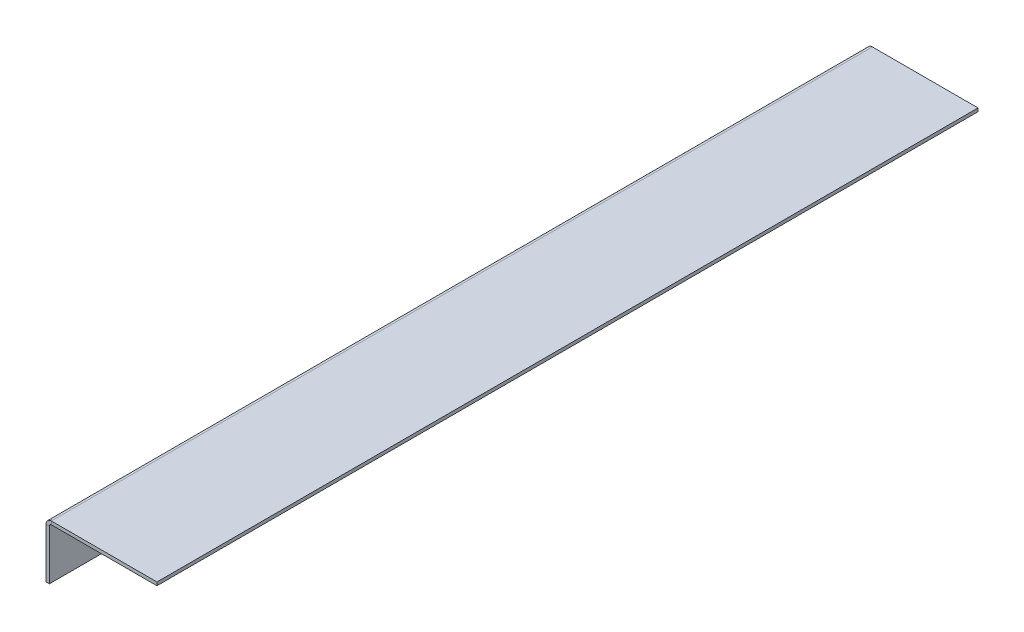
ISO-10303-21;
HEADER;
FILE_DESCRIPTION(('STEP AP214'),'2;1');
FILE_NAME('part.step','',(''),(''),'','','');
FILE_SCHEMA(('AUTOMOTIVE_DESIGN { 1 0 10303 214 1 1 1 1 }'));
ENDSEC;
DATA;
#1=APPLICATION_CONTEXT('core data for automotive mechanical design processes');
#2=APPLICATION_PROTOCOL_DEFINITION('international standard','automotive_design',2000,#1);
#3=PRODUCT_CONTEXT('',#1,'mechanical');
#4=PRODUCT('Part','Part','',(#3));
#5=PRODUCT_RELATED_PRODUCT_CATEGORY('part','',(#4));
#6=PRODUCT_DEFINITION_FORMATION('','',#4);
#7=PRODUCT_DEFINITION_CONTEXT('part definition',#1,'design');
#8=PRODUCT_DEFINITION('design','',#6,#7);
#9=PRODUCT_DEFINITION_SHAPE('','',#8);
#10=(LENGTH_UNIT() NAMED_UNIT(*) SI_UNIT(.MILLI.,.METRE.));
#11=(NAMED_UNIT(*) PLANE_ANGLE_UNIT() SI_UNIT($,.RADIAN.));
#12=(NAMED_UNIT(*) SI_UNIT($,.STERADIAN.) SOLID_ANGLE_UNIT());
#13=UNCERTAINTY_MEASURE_WITH_UNIT(LENGTH_MEASURE(1.E-05),#10,'distance_accuracy_value','');
#14=(GEOMETRIC_REPRESENTATION_CONTEXT(3) GLOBAL_UNCERTAINTY_ASSIGNED_CONTEXT((#13)) GLOBAL_UNIT_ASSIGNED_CONTEXT((#10,
#11,#12)) REPRESENTATION_CONTEXT('',''));
#15=CARTESIAN_POINT('',(0.,0.,0.));
#16=DIRECTION('',(0.,0.,1.));
#17=DIRECTION('',(1.,0.,0.));
#18=AXIS2_PLACEMENT_3D('',#15,#16,#17);
#19=CARTESIAN_POINT('',(1.9366,20.,296.));
#20=DIRECTION('',(0.,0.,1.));
#21=DIRECTION('',(1.,0.,0.));
#22=AXIS2_PLACEMENT_3D('',#19,#20,#21);
#23=PLANE('',#22);
#24=DIRECTION('',(0.,-1.,0.));
#25=VECTOR('',#24,1.);
#26=CARTESIAN_POINT('',(1.9366,20.,296.));
#27=LINE('',#26,#25);
#28=CARTESIAN_POINT('',(1.9366,20.,296.));
#29=VERTEX_POINT('',#28);
#30=CARTESIAN_POINT('',(1.9366,18.8,296.));
#31=VERTEX_POINT('',#30);
#32=EDGE_CURVE('E11',#29,#31,#27,.T.);
#33=ORIENTED_EDGE('',*,*,#32,.F.);
#34=CARTESIAN_POINT('',(1.9366,18.0634,296.));
#35=DIRECTION('',(0.,0.,1.));
#36=DIRECTION('',(1.,0.,0.));
#37=AXIS2_PLACEMENT_3D('',#34,#35,#36);
#38=CIRCLE('',#37,1.9366);
#39=CARTESIAN_POINT('',(0.,18.0634,296.));
#40=VERTEX_POINT('',#39);
#41=EDGE_CURVE('E140',#40,#29,#38,.F.);
#42=ORIENTED_EDGE('',*,*,#41,.F.);
#43=DIRECTION('',(-1.,0.,0.));
#44=VECTOR('',#43,1.);
#45=CARTESIAN_POINT('',(1.2,18.0634,296.));
#46=LINE('',#45,#44);
#47=CARTESIAN_POINT('',(1.2,18.0634,296.));
#48=VERTEX_POINT('',#47);
#49=EDGE_CURVE('E51',#48,#40,#46,.T.);
#50=ORIENTED_EDGE('',*,*,#49,.F.);
#51=CARTESIAN_POINT('',(1.9366,18.0634,296.));
#52=DIRECTION('',(0.,0.,1.));
#53=DIRECTION('',(1.,0.,0.));
#54=AXIS2_PLACEMENT_3D('',#51,#52,#53);
#55=CIRCLE('',#54,0.7366);
#56=EDGE_CURVE('E133',#48,#31,#55,.F.);
#57=ORIENTED_EDGE('',*,*,#56,.T.);
#58=EDGE_LOOP('',(#33,#42,#50,#57));
#59=FACE_BOUND('',#58,.T.);
#60=ADVANCED_FACE('F43',(#59),#23,.T.);
#61=CARTESIAN_POINT('',(1.2,18.0634,296.));
#62=DIRECTION('',(0.,0.,1.));
#63=DIRECTION('',(1.,0.,0.));
#64=AXIS2_PLACEMENT_3D('',#61,#62,#63);
#65=PLANE('',#64);
#66=DIRECTION('',(1.,0.,0.));
#67=VECTOR('',#66,1.);
#68=CARTESIAN_POINT('',(0.,20.,296.));
#69=LINE('',#68,#67);
#70=CARTESIAN_POINT('',(40.,20.,296.));
#71=VERTEX_POINT('',#70);
#72=EDGE_CURVE('E189',#29,#71,#69,.T.);
#73=ORIENTED_EDGE('',*,*,#72,.F.);
#74=ORIENTED_EDGE('',*,*,#32,.T.);
#75=DIRECTION('',(1.,0.,0.));
#76=VECTOR('',#75,1.);
#77=CARTESIAN_POINT('',(0.,18.8,296.));
#78=LINE('',#77,#76);
#79=CARTESIAN_POINT('',(40.,18.8,296.));
#80=VERTEX_POINT('',#79);
#81=EDGE_CURVE('E99',#31,#80,#78,.T.);
#82=ORIENTED_EDGE('',*,*,#81,.T.);
#83=DIRECTION('',(0.,-1.,0.));
#84=VECTOR('',#83,1.);
#85=CARTESIAN_POINT('',(40.,20.,296.));
#86=LINE('',#85,#84);
#87=EDGE_CURVE('E374',#71,#80,#86,.T.);
#88=ORIENTED_EDGE('',*,*,#87,.F.);
#89=EDGE_LOOP('',(#73,#74,#82,#88));
#90=FACE_BOUND('',#89,.T.);
#91=ADVANCED_FACE('F197',(#90),#65,.T.);
#92=CARTESIAN_POINT('',(0.,18.0634,0.));
#93=DIRECTION('',(0.,0.,-1.));
#94=DIRECTION('',(-1.,0.,0.));
#95=AXIS2_PLACEMENT_3D('',#92,#93,#94);
#96=PLANE('',#95);
#97=DIRECTION('',(1.,0.,0.));
#98=VECTOR('',#97,1.);
#99=CARTESIAN_POINT('',(0.,18.0634,0.));
#100=LINE('',#99,#98);
#101=CARTESIAN_POINT('',(0.,18.0634,0.));
#102=VERTEX_POINT('',#101);
#103=CARTESIAN_POINT('',(1.2,18.0634,0.));
#104=VERTEX_POINT('',#103);
#105=EDGE_CURVE('E86',#102,#104,#100,.T.);
#106=ORIENTED_EDGE('',*,*,#105,.F.);
#107=CARTESIAN_POINT('',(1.9366,18.0634,0.));
#108=DIRECTION('',(0.,0.,1.));
#109=DIRECTION('',(1.,0.,0.));
#110=AXIS2_PLACEMENT_3D('',#107,#108,#109);
#111=CIRCLE('',#110,1.9366);
#112=CARTESIAN_POINT('',(1.9366,20.,0.));
#113=VERTEX_POINT('',#112);
#114=EDGE_CURVE('E155',#102,#113,#111,.F.);
#115=ORIENTED_EDGE('',*,*,#114,.T.);
#116=DIRECTION('',(0.,1.,0.));
#117=VECTOR('',#116,1.);
#118=CARTESIAN_POINT('',(1.9366,18.8,0.));
#119=LINE('',#118,#117);
#120=CARTESIAN_POINT('',(1.9366,18.8,0.));
#121=VERTEX_POINT('',#120);
#122=EDGE_CURVE('E93',#121,#113,#119,.T.);
#123=ORIENTED_EDGE('',*,*,#122,.F.);
#124=CARTESIAN_POINT('',(1.9366,18.0634,0.));
#125=DIRECTION('',(0.,0.,1.));
#126=DIRECTION('',(1.,0.,0.));
#127=AXIS2_PLACEMENT_3D('',#124,#125,#126);
#128=CIRCLE('',#127,0.7366);
#129=EDGE_CURVE('E162',#104,#121,#128,.F.);
#130=ORIENTED_EDGE('',*,*,#129,.F.);
#131=EDGE_LOOP('',(#106,#115,#123,#130));
#132=FACE_BOUND('',#131,.T.);
#133=ADVANCED_FACE('F195',(#132),#96,.T.);
#134=CARTESIAN_POINT('',(1.9366,18.8,0.));
#135=DIRECTION('',(0.,0.,-1.));
#136=DIRECTION('',(-1.,0.,0.));
#137=AXIS2_PLACEMENT_3D('',#134,#135,#136);
#138=PLANE('',#137);
#139=DIRECTION('',(0.,1.,0.));
#140=VECTOR('',#139,1.);
#141=CARTESIAN_POINT('',(0.,0.,0.));
#142=LINE('',#141,#140);
#143=CARTESIAN_POINT('',(0.,0.,0.));
#144=VERTEX_POINT('',#143);
#145=EDGE_CURVE('E157',#144,#102,#142,.T.);
#146=ORIENTED_EDGE('',*,*,#145,.T.);
#147=ORIENTED_EDGE('',*,*,#105,.T.);
#148=DIRECTION('',(0.,1.,0.));
#149=VECTOR('',#148,1.);
#150=CARTESIAN_POINT('',(1.2,0.,0.));
#151=LINE('',#150,#149);
#152=CARTESIAN_POINT('',(1.2,0.,0.));
#153=VERTEX_POINT('',#152);
#154=EDGE_CURVE('E160',#153,#104,#151,.T.);
#155=ORIENTED_EDGE('',*,*,#154,.F.);
#156=DIRECTION('',(-1.,0.,0.));
#157=VECTOR('',#156,1.);
#158=CARTESIAN_POINT('',(1.2,0.,0.));
#159=LINE('',#158,#157);
#160=EDGE_CURVE('E121',#153,#144,#159,.T.);
#161=ORIENTED_EDGE('',*,*,#160,.T.);
#162=EDGE_LOOP('',(#146,#147,#155,#161));
#163=FACE_BOUND('',#162,.T.);
#164=ADVANCED_FACE('F191',(#163),#138,.T.);
#165=CARTESIAN_POINT('',(0.,18.8,296.));
#166=DIRECTION('',(0.,1.,0.));
#167=DIRECTION('',(0.,0.,1.));
#168=AXIS2_PLACEMENT_3D('',#165,#166,#167);
#169=PLANE('',#168);
#170=DIRECTION('',(1.,0.,0.));
#171=VECTOR('',#170,1.);
#172=CARTESIAN_POINT('',(0.,18.8,0.));
#173=LINE('',#172,#171);
#174=CARTESIAN_POINT('',(40.,18.8,0.));
#175=VERTEX_POINT('',#174);
#176=EDGE_CURVE('E146',#121,#175,#173,.T.);
#177=ORIENTED_EDGE('',*,*,#176,.T.);
#178=DIRECTION('',(0.,0.,-1.));
#179=VECTOR('',#178,1.);
#180=CARTESIAN_POINT('',(40.,18.8,296.));
#181=LINE('',#180,#179);
#182=EDGE_CURVE('E176',#80,#175,#181,.T.);
#183=ORIENTED_EDGE('',*,*,#182,.F.);
#184=ORIENTED_EDGE('',*,*,#81,.F.);
#185=DIRECTION('',(0.,0.,-1.));
#186=VECTOR('',#185,1.);
#187=CARTESIAN_POINT('',(1.9366,18.8,296.));
#188=LINE('',#187,#186);
#189=EDGE_CURVE('E145',#31,#121,#188,.T.);
#190=ORIENTED_EDGE('',*,*,#189,.T.);
#191=EDGE_LOOP('',(#177,#183,#184,#190));
#192=FACE_BOUND('',#191,.T.);
#193=ADVANCED_FACE('F203',(#192),#169,.F.);
#194=CARTESIAN_POINT('',(40.,20.,296.));
#195=DIRECTION('',(1.,0.,0.));
#196=DIRECTION('',(0.,0.,-1.));
#197=AXIS2_PLACEMENT_3D('',#194,#195,#196);
#198=PLANE('',#197);
#199=DIRECTION('',(0.,-1.,0.));
#200=VECTOR('',#199,1.);
#201=CARTESIAN_POINT('',(40.,20.,0.));
#202=LINE('',#201,#200);
#203=CARTESIAN_POINT('',(40.,20.,0.));
#204=VERTEX_POINT('',#203);
#205=EDGE_CURVE('E149',#204,#175,#202,.T.);
#206=ORIENTED_EDGE('',*,*,#205,.F.);
#207=DIRECTION('',(0.,0.,-1.));
#208=VECTOR('',#207,1.);
#209=CARTESIAN_POINT('',(40.,20.,296.));
#210=LINE('',#209,#208);
#211=EDGE_CURVE('E174',#71,#204,#210,.T.);
#212=ORIENTED_EDGE('',*,*,#211,.F.);
#213=ORIENTED_EDGE('',*,*,#87,.T.);
#214=ORIENTED_EDGE('',*,*,#182,.T.);
#215=EDGE_LOOP('',(#206,#212,#213,#214));
#216=FACE_BOUND('',#215,.T.);
#217=ADVANCED_FACE('F234',(#216),#198,.T.);
#218=CARTESIAN_POINT('',(0.,20.,296.));
#219=DIRECTION('',(0.,1.,0.));
#220=DIRECTION('',(0.,0.,1.));
#221=AXIS2_PLACEMENT_3D('',#218,#219,#220);
#222=PLANE('',#221);
#223=DIRECTION('',(1.,0.,0.));
#224=VECTOR('',#223,1.);
#225=CARTESIAN_POINT('',(0.,20.,0.));
#226=LINE('',#225,#224);
#227=EDGE_CURVE('E152',#113,#204,#226,.T.);
#228=ORIENTED_EDGE('',*,*,#227,.F.);
#229=DIRECTION('',(0.,0.,-1.));
#230=VECTOR('',#229,1.);
#231=CARTESIAN_POINT('',(1.9366,20.,296.));
#232=LINE('',#231,#230);
#233=EDGE_CURVE('E171',#29,#113,#232,.T.);
#234=ORIENTED_EDGE('',*,*,#233,.F.);
#235=ORIENTED_EDGE('',*,*,#72,.T.);
#236=ORIENTED_EDGE('',*,*,#211,.T.);
#237=EDGE_LOOP('',(#228,#234,#235,#236));
#238=FACE_BOUND('',#237,.T.);
#239=ADVANCED_FACE('F245',(#238),#222,.T.);
#240=CARTESIAN_POINT('',(1.9366,18.0634,296.));
#241=DIRECTION('',(0.,0.,-1.));
#242=DIRECTION('',(-1.,0.,0.));
#243=AXIS2_PLACEMENT_3D('',#240,#241,#242);
#244=CYLINDRICAL_SURFACE('',#243,1.9366);
#245=ORIENTED_EDGE('',*,*,#114,.F.);
#246=DIRECTION('',(0.,0.,-1.));
#247=VECTOR('',#246,1.);
#248=CARTESIAN_POINT('',(0.,18.0634,296.));
#249=LINE('',#248,#247);
#250=EDGE_CURVE('E168',#40,#102,#249,.T.);
#251=ORIENTED_EDGE('',*,*,#250,.F.);
#252=ORIENTED_EDGE('',*,*,#41,.T.);
#253=ORIENTED_EDGE('',*,*,#233,.T.);
#254=EDGE_LOOP('',(#245,#251,#252,#253));
#255=FACE_BOUND('',#254,.T.);
#256=ADVANCED_FACE('F185',(#255),#244,.T.);
#257=CARTESIAN_POINT('',(0.,0.,296.));
#258=DIRECTION('',(-1.,0.,0.));
#259=DIRECTION('',(0.,0.,1.));
#260=AXIS2_PLACEMENT_3D('',#257,#258,#259);
#261=PLANE('',#260);
#262=ORIENTED_EDGE('',*,*,#145,.F.);
#263=DIRECTION('',(0.,0.,-1.));
#264=VECTOR('',#263,1.);
#265=CARTESIAN_POINT('',(0.,0.,296.));
#266=LINE('',#265,#264);
#267=CARTESIAN_POINT('',(0.,0.,296.));
#268=VERTEX_POINT('',#267);
#269=EDGE_CURVE('E123',#268,#144,#266,.T.);
#270=ORIENTED_EDGE('',*,*,#269,.F.);
#271=DIRECTION('',(0.,1.,0.));
#272=VECTOR('',#271,1.);
#273=CARTESIAN_POINT('',(0.,0.,296.));
#274=LINE('',#273,#272);
#275=EDGE_CURVE('E138',#268,#40,#274,.T.);
#276=ORIENTED_EDGE('',*,*,#275,.T.);
#277=ORIENTED_EDGE('',*,*,#250,.T.);
#278=EDGE_LOOP('',(#262,#270,#276,#277));
#279=FACE_BOUND('',#278,.T.);
#280=ADVANCED_FACE('F190',(#279),#261,.T.);
#281=CARTESIAN_POINT('',(1.2,0.,296.));
#282=DIRECTION('',(0.,-1.,0.));
#283=DIRECTION('',(0.,0.,-1.));
#284=AXIS2_PLACEMENT_3D('',#281,#282,#283);
#285=PLANE('',#284);
#286=ORIENTED_EDGE('',*,*,#160,.F.);
#287=DIRECTION('',(0.,0.,-1.));
#288=VECTOR('',#287,1.);
#289=CARTESIAN_POINT('',(1.2,0.,296.));
#290=LINE('',#289,#288);
#291=CARTESIAN_POINT('',(1.2,0.,296.));
#292=VERTEX_POINT('',#291);
#293=EDGE_CURVE('E115',#292,#153,#290,.T.);
#294=ORIENTED_EDGE('',*,*,#293,.F.);
#295=DIRECTION('',(-1.,0.,0.));
#296=VECTOR('',#295,1.);
#297=CARTESIAN_POINT('',(1.2,0.,296.));
#298=LINE('',#297,#296);
#299=EDGE_CURVE('E119',#292,#268,#298,.T.);
#300=ORIENTED_EDGE('',*,*,#299,.T.);
#301=ORIENTED_EDGE('',*,*,#269,.T.);
#302=EDGE_LOOP('',(#286,#294,#300,#301));
#303=FACE_BOUND('',#302,.T.);
#304=ADVANCED_FACE('F117',(#303),#285,.T.);
#305=CARTESIAN_POINT('',(1.2,0.,296.));
#306=DIRECTION('',(-1.,0.,0.));
#307=DIRECTION('',(0.,0.,1.));
#308=AXIS2_PLACEMENT_3D('',#305,#306,#307);
#309=PLANE('',#308);
#310=ORIENTED_EDGE('',*,*,#154,.T.);
#311=DIRECTION('',(0.,0.,-1.));
#312=VECTOR('',#311,1.);
#313=CARTESIAN_POINT('',(1.2,18.0634,296.));
#314=LINE('',#313,#312);
#315=EDGE_CURVE('E124',#48,#104,#314,.T.);
#316=ORIENTED_EDGE('',*,*,#315,.F.);
#317=DIRECTION('',(0.,1.,0.));
#318=VECTOR('',#317,1.);
#319=CARTESIAN_POINT('',(1.2,0.,296.));
#320=LINE('',#319,#318);
#321=EDGE_CURVE('E128',#292,#48,#320,.T.);
#322=ORIENTED_EDGE('',*,*,#321,.F.);
#323=ORIENTED_EDGE('',*,*,#293,.T.);
#324=EDGE_LOOP('',(#310,#316,#322,#323));
#325=FACE_BOUND('',#324,.T.);
#326=ADVANCED_FACE('F129',(#325),#309,.F.);
#327=CARTESIAN_POINT('',(1.9366,18.0634,296.));
#328=DIRECTION('',(0.,0.,-1.));
#329=DIRECTION('',(-1.,0.,0.));
#330=AXIS2_PLACEMENT_3D('',#327,#328,#329);
#331=CYLINDRICAL_SURFACE('',#330,0.7366);
#332=ORIENTED_EDGE('',*,*,#129,.T.);
#333=ORIENTED_EDGE('',*,*,#189,.F.);
#334=ORIENTED_EDGE('',*,*,#56,.F.);
#335=ORIENTED_EDGE('',*,*,#315,.T.);
#336=EDGE_LOOP('',(#332,#333,#334,#335));
#337=FACE_BOUND('',#336,.T.);
#338=ADVANCED_FACE('F193',(#337),#331,.F.);
#339=CARTESIAN_POINT('',(1.9366,18.0634,296.));
#340=DIRECTION('',(0.,0.,1.));
#341=DIRECTION('',(1.,0.,0.));
#342=AXIS2_PLACEMENT_3D('',#339,#340,#341);
#343=PLANE('',#342);
#344=ORIENTED_EDGE('',*,*,#321,.T.);
#345=ORIENTED_EDGE('',*,*,#49,.T.);
#346=ORIENTED_EDGE('',*,*,#275,.F.);
#347=ORIENTED_EDGE('',*,*,#299,.F.);
#348=EDGE_LOOP('',(#344,#345,#346,#347));
#349=FACE_BOUND('',#348,.T.);
#350=ADVANCED_FACE('F136',(#349),#343,.T.);
#351=CARTESIAN_POINT('',(1.9366,18.0634,0.));
#352=DIRECTION('',(0.,0.,1.));
#353=DIRECTION('',(1.,0.,0.));
#354=AXIS2_PLACEMENT_3D('',#351,#352,#353);
#355=PLANE('',#354);
#356=ORIENTED_EDGE('',*,*,#176,.F.);
#357=ORIENTED_EDGE('',*,*,#122,.T.);
#358=ORIENTED_EDGE('',*,*,#227,.T.);
#359=ORIENTED_EDGE('',*,*,#205,.T.);
#360=EDGE_LOOP('',(#356,#357,#358,#359));
#361=FACE_BOUND('',#360,.T.);
#362=ADVANCED_FACE('F311',(#361),#355,.F.);
#363=CLOSED_SHELL('',(#60,#91,#133,#164,#193,#217,#239,#256,#280,#304,#326,#338,#350,#362));
#364=MANIFOLD_SOLID_BREP('B2',#363);
#365=ADVANCED_BREP_SHAPE_REPRESENTATION('',(#18,#364),#14);
#366=SHAPE_DEFINITION_REPRESENTATION(#9,#365);
ENDSEC;
END-ISO-10303-21;
